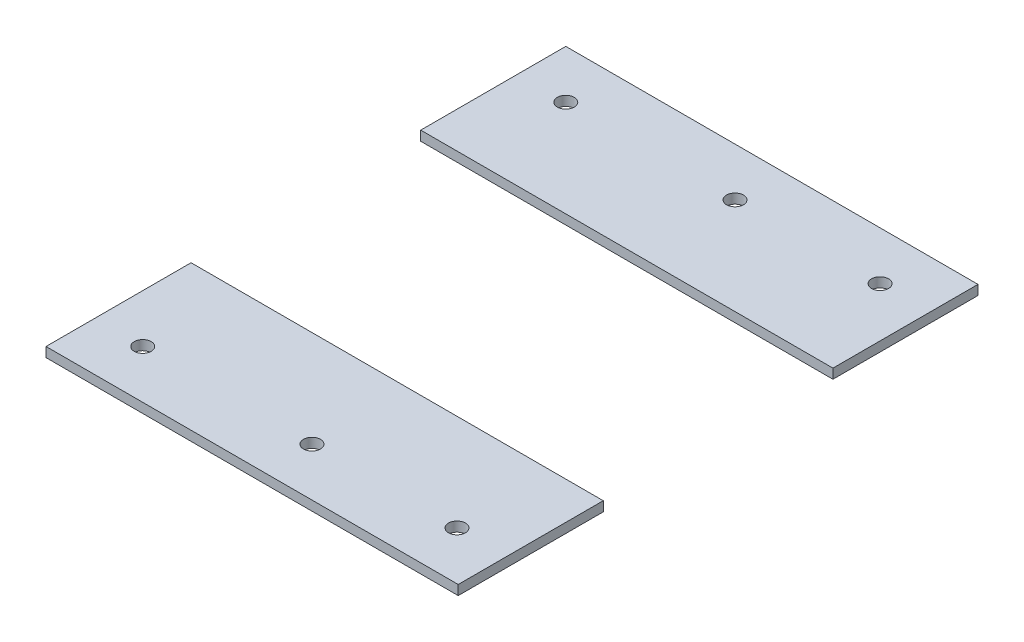
ISO-10303-21;
HEADER;
FILE_DESCRIPTION(('STEP AP214'),'2;1');
FILE_NAME('part.step','',(''),(''),'','','');
FILE_SCHEMA(('AUTOMOTIVE_DESIGN { 1 0 10303 214 1 1 1 1 }'));
ENDSEC;
DATA;
#1=APPLICATION_CONTEXT('core data for automotive mechanical design processes');
#2=APPLICATION_PROTOCOL_DEFINITION('international standard','automotive_design',2000,#1);
#3=PRODUCT_CONTEXT('',#1,'mechanical');
#4=PRODUCT('Part','Part','',(#3));
#5=PRODUCT_RELATED_PRODUCT_CATEGORY('part','',(#4));
#6=PRODUCT_DEFINITION_FORMATION('','',#4);
#7=PRODUCT_DEFINITION_CONTEXT('part definition',#1,'design');
#8=PRODUCT_DEFINITION('design','',#6,#7);
#9=PRODUCT_DEFINITION_SHAPE('','',#8);
#10=(LENGTH_UNIT() NAMED_UNIT(*) SI_UNIT(.MILLI.,.METRE.));
#11=(NAMED_UNIT(*) PLANE_ANGLE_UNIT() SI_UNIT($,.RADIAN.));
#12=(NAMED_UNIT(*) SI_UNIT($,.STERADIAN.) SOLID_ANGLE_UNIT());
#13=UNCERTAINTY_MEASURE_WITH_UNIT(LENGTH_MEASURE(1.E-05),#10,'distance_accuracy_value','');
#14=(GEOMETRIC_REPRESENTATION_CONTEXT(3) GLOBAL_UNCERTAINTY_ASSIGNED_CONTEXT((#13)) GLOBAL_UNIT_ASSIGNED_CONTEXT((#10,
#11,#12)) REPRESENTATION_CONTEXT('',''));
#15=CARTESIAN_POINT('',(0.,0.,0.));
#16=DIRECTION('',(0.,0.,1.));
#17=DIRECTION('',(1.,0.,0.));
#18=AXIS2_PLACEMENT_3D('',#15,#16,#17);
#19=CARTESIAN_POINT('',(0.,4.,0.));
#20=DIRECTION('',(0.,1.,0.));
#21=DIRECTION('',(0.,0.,1.));
#22=AXIS2_PLACEMENT_3D('',#19,#20,#21);
#23=PLANE('',#22);
#24=DIRECTION('',(-1.,0.,0.));
#25=VECTOR('',#24,1.);
#26=CARTESIAN_POINT('',(0.,4.,-145.));
#27=LINE('',#26,#25);
#28=CARTESIAN_POINT('',(170.5,4.,-145.));
#29=VERTEX_POINT('',#28);
#30=CARTESIAN_POINT('',(0.,4.,-145.));
#31=VERTEX_POINT('',#30);
#32=EDGE_CURVE('E12',#29,#31,#27,.T.);
#33=ORIENTED_EDGE('',*,*,#32,.F.);
#34=DIRECTION('',(0.,0.,-1.));
#35=VECTOR('',#34,1.);
#36=CARTESIAN_POINT('',(170.5,4.,-205.));
#37=LINE('',#36,#35);
#38=CARTESIAN_POINT('',(170.5,4.,-205.));
#39=VERTEX_POINT('',#38);
#40=EDGE_CURVE('E101',#29,#39,#37,.T.);
#41=ORIENTED_EDGE('',*,*,#40,.T.);
#42=DIRECTION('',(-1.,0.,0.));
#43=VECTOR('',#42,1.);
#44=CARTESIAN_POINT('',(0.,4.,-205.));
#45=LINE('',#44,#43);
#46=CARTESIAN_POINT('',(0.,4.,-205.));
#47=VERTEX_POINT('',#46);
#48=EDGE_CURVE('E118',#39,#47,#45,.T.);
#49=ORIENTED_EDGE('',*,*,#48,.T.);
#50=DIRECTION('',(0.,0.,1.));
#51=VECTOR('',#50,1.);
#52=CARTESIAN_POINT('',(0.,4.,-205.));
#53=LINE('',#52,#51);
#54=EDGE_CURVE('E113',#47,#31,#53,.T.);
#55=ORIENTED_EDGE('',*,*,#54,.T.);
#56=EDGE_LOOP('',(#33,#41,#49,#55));
#57=FACE_BOUND('',#56,.T.);
#58=CARTESIAN_POINT('',(20.,4.,-185.));
#59=DIRECTION('',(0.,1.,0.));
#60=DIRECTION('',(0.,0.,1.));
#61=AXIS2_PLACEMENT_3D('',#58,#59,#60);
#62=CIRCLE('',#61,3.5);
#63=CARTESIAN_POINT('',(20.,4.,-181.5));
#64=VERTEX_POINT('',#63);
#65=EDGE_CURVE('E93',#64,#64,#62,.T.);
#66=ORIENTED_EDGE('',*,*,#65,.F.);
#67=EDGE_LOOP('',(#66));
#68=FACE_BOUND('',#67,.T.);
#69=CARTESIAN_POINT('',(90.,4.,-185.));
#70=DIRECTION('',(0.,1.,0.));
#71=DIRECTION('',(0.,0.,1.));
#72=AXIS2_PLACEMENT_3D('',#69,#70,#71);
#73=CIRCLE('',#72,3.50000000000001);
#74=CARTESIAN_POINT('',(90.,4.,-181.5));
#75=VERTEX_POINT('',#74);
#76=EDGE_CURVE('E134',#75,#75,#73,.T.);
#77=ORIENTED_EDGE('',*,*,#76,.F.);
#78=EDGE_LOOP('',(#77));
#79=FACE_BOUND('',#78,.T.);
#80=CARTESIAN_POINT('',(150.,4.,-185.));
#81=DIRECTION('',(0.,1.,0.));
#82=DIRECTION('',(0.,0.,1.));
#83=AXIS2_PLACEMENT_3D('',#80,#81,#82);
#84=CIRCLE('',#83,3.49999999999999);
#85=CARTESIAN_POINT('',(150.,4.,-181.5));
#86=VERTEX_POINT('',#85);
#87=EDGE_CURVE('E126',#86,#86,#84,.T.);
#88=ORIENTED_EDGE('',*,*,#87,.F.);
#89=EDGE_LOOP('',(#88));
#90=FACE_BOUND('',#89,.T.);
#91=ADVANCED_FACE('F49',(#57,#68,#79,#90),#23,.T.);
#92=CARTESIAN_POINT('',(0.,0.,0.));
#93=DIRECTION('',(0.,1.,0.));
#94=DIRECTION('',(0.,0.,1.));
#95=AXIS2_PLACEMENT_3D('',#92,#93,#94);
#96=PLANE('',#95);
#97=CARTESIAN_POINT('',(20.,0.,-185.));
#98=DIRECTION('',(0.,1.,0.));
#99=DIRECTION('',(0.,0.,1.));
#100=AXIS2_PLACEMENT_3D('',#97,#98,#99);
#101=CIRCLE('',#100,3.5);
#102=CARTESIAN_POINT('',(20.,0.,-181.5));
#103=VERTEX_POINT('',#102);
#104=EDGE_CURVE('E117',#103,#103,#101,.T.);
#105=ORIENTED_EDGE('',*,*,#104,.T.);
#106=EDGE_LOOP('',(#105));
#107=FACE_BOUND('',#106,.T.);
#108=CARTESIAN_POINT('',(150.,0.,-185.));
#109=DIRECTION('',(0.,1.,0.));
#110=DIRECTION('',(0.,0.,1.));
#111=AXIS2_PLACEMENT_3D('',#108,#109,#110);
#112=CIRCLE('',#111,3.49999999999999);
#113=CARTESIAN_POINT('',(150.,0.,-181.5));
#114=VERTEX_POINT('',#113);
#115=EDGE_CURVE('E130',#114,#114,#112,.T.);
#116=ORIENTED_EDGE('',*,*,#115,.T.);
#117=EDGE_LOOP('',(#116));
#118=FACE_BOUND('',#117,.T.);
#119=CARTESIAN_POINT('',(90.,0.,-185.));
#120=DIRECTION('',(0.,1.,0.));
#121=DIRECTION('',(0.,0.,1.));
#122=AXIS2_PLACEMENT_3D('',#119,#120,#121);
#123=CIRCLE('',#122,3.50000000000001);
#124=CARTESIAN_POINT('',(90.,0.,-181.5));
#125=VERTEX_POINT('',#124);
#126=EDGE_CURVE('E138',#125,#125,#123,.T.);
#127=ORIENTED_EDGE('',*,*,#126,.T.);
#128=EDGE_LOOP('',(#127));
#129=FACE_BOUND('',#128,.T.);
#130=DIRECTION('',(0.,0.,-1.));
#131=VECTOR('',#130,1.);
#132=CARTESIAN_POINT('',(170.5,0.,-205.));
#133=LINE('',#132,#131);
#134=CARTESIAN_POINT('',(170.5,0.,-145.));
#135=VERTEX_POINT('',#134);
#136=CARTESIAN_POINT('',(170.5,0.,-205.));
#137=VERTEX_POINT('',#136);
#138=EDGE_CURVE('E99',#135,#137,#133,.T.);
#139=ORIENTED_EDGE('',*,*,#138,.F.);
#140=DIRECTION('',(1.,0.,0.));
#141=VECTOR('',#140,1.);
#142=CARTESIAN_POINT('',(194.467368696575,0.,-145.));
#143=LINE('',#142,#141);
#144=CARTESIAN_POINT('',(0.,0.,-145.));
#145=VERTEX_POINT('',#144);
#146=EDGE_CURVE('E58',#145,#135,#143,.T.);
#147=ORIENTED_EDGE('',*,*,#146,.F.);
#148=DIRECTION('',(0.,0.,1.));
#149=VECTOR('',#148,1.);
#150=CARTESIAN_POINT('',(0.,0.,-205.));
#151=LINE('',#150,#149);
#152=CARTESIAN_POINT('',(0.,0.,-205.));
#153=VERTEX_POINT('',#152);
#154=EDGE_CURVE('E52',#153,#145,#151,.T.);
#155=ORIENTED_EDGE('',*,*,#154,.F.);
#156=DIRECTION('',(-1.,0.,0.));
#157=VECTOR('',#156,1.);
#158=CARTESIAN_POINT('',(0.,0.,-205.));
#159=LINE('',#158,#157);
#160=EDGE_CURVE('E107',#137,#153,#159,.T.);
#161=ORIENTED_EDGE('',*,*,#160,.F.);
#162=EDGE_LOOP('',(#139,#147,#155,#161));
#163=FACE_BOUND('',#162,.T.);
#164=ADVANCED_FACE('F106',(#107,#118,#129,#163),#96,.F.);
#165=CARTESIAN_POINT('',(0.,4.,-205.));
#166=DIRECTION('',(1.,0.,0.));
#167=DIRECTION('',(0.,0.,-1.));
#168=AXIS2_PLACEMENT_3D('',#165,#166,#167);
#169=PLANE('',#168);
#170=ORIENTED_EDGE('',*,*,#154,.T.);
#171=DIRECTION('',(0.,1.,0.));
#172=VECTOR('',#171,1.);
#173=CARTESIAN_POINT('',(0.,4.,-145.));
#174=LINE('',#173,#172);
#175=EDGE_CURVE('E65',#145,#31,#174,.T.);
#176=ORIENTED_EDGE('',*,*,#175,.T.);
#177=ORIENTED_EDGE('',*,*,#54,.F.);
#178=DIRECTION('',(0.,-1.,0.));
#179=VECTOR('',#178,1.);
#180=CARTESIAN_POINT('',(0.,4.,-205.));
#181=LINE('',#180,#179);
#182=EDGE_CURVE('E103',#47,#153,#181,.T.);
#183=ORIENTED_EDGE('',*,*,#182,.T.);
#184=EDGE_LOOP('',(#170,#176,#177,#183));
#185=FACE_BOUND('',#184,.T.);
#186=ADVANCED_FACE('F159',(#185),#169,.F.);
#187=CARTESIAN_POINT('',(170.5,4.,-205.));
#188=DIRECTION('',(-1.,0.,0.));
#189=DIRECTION('',(0.,0.,1.));
#190=AXIS2_PLACEMENT_3D('',#187,#188,#189);
#191=PLANE('',#190);
#192=ORIENTED_EDGE('',*,*,#40,.F.);
#193=DIRECTION('',(0.,-1.,0.));
#194=VECTOR('',#193,1.);
#195=CARTESIAN_POINT('',(170.5,4.,-145.));
#196=LINE('',#195,#194);
#197=EDGE_CURVE('E87',#29,#135,#196,.T.);
#198=ORIENTED_EDGE('',*,*,#197,.T.);
#199=ORIENTED_EDGE('',*,*,#138,.T.);
#200=DIRECTION('',(0.,-1.,0.));
#201=VECTOR('',#200,1.);
#202=CARTESIAN_POINT('',(170.5,4.,-205.));
#203=LINE('',#202,#201);
#204=EDGE_CURVE('E110',#39,#137,#203,.T.);
#205=ORIENTED_EDGE('',*,*,#204,.F.);
#206=EDGE_LOOP('',(#192,#198,#199,#205));
#207=FACE_BOUND('',#206,.T.);
#208=ADVANCED_FACE('F97',(#207),#191,.F.);
#209=CARTESIAN_POINT('',(0.,4.,-205.));
#210=DIRECTION('',(0.,0.,1.));
#211=DIRECTION('',(1.,0.,0.));
#212=AXIS2_PLACEMENT_3D('',#209,#210,#211);
#213=PLANE('',#212);
#214=ORIENTED_EDGE('',*,*,#160,.T.);
#215=ORIENTED_EDGE('',*,*,#182,.F.);
#216=ORIENTED_EDGE('',*,*,#48,.F.);
#217=ORIENTED_EDGE('',*,*,#204,.T.);
#218=EDGE_LOOP('',(#214,#215,#216,#217));
#219=FACE_BOUND('',#218,.T.);
#220=ADVANCED_FACE('F153',(#219),#213,.F.);
#221=CARTESIAN_POINT('',(90.,4.,-185.));
#222=DIRECTION('',(0.,-1.,0.));
#223=DIRECTION('',(0.,0.,-1.));
#224=AXIS2_PLACEMENT_3D('',#221,#222,#223);
#225=CYLINDRICAL_SURFACE('',#224,3.50000000000001);
#226=ORIENTED_EDGE('',*,*,#76,.T.);
#227=EDGE_LOOP('',(#226));
#228=FACE_BOUND('',#227,.T.);
#229=ORIENTED_EDGE('',*,*,#126,.F.);
#230=EDGE_LOOP('',(#229));
#231=FACE_BOUND('',#230,.T.);
#232=ADVANCED_FACE('F195',(#228,#231),#225,.F.);
#233=CARTESIAN_POINT('',(150.,4.,-185.));
#234=DIRECTION('',(0.,-1.,0.));
#235=DIRECTION('',(0.,0.,-1.));
#236=AXIS2_PLACEMENT_3D('',#233,#234,#235);
#237=CYLINDRICAL_SURFACE('',#236,3.49999999999999);
#238=ORIENTED_EDGE('',*,*,#87,.T.);
#239=EDGE_LOOP('',(#238));
#240=FACE_BOUND('',#239,.T.);
#241=ORIENTED_EDGE('',*,*,#115,.F.);
#242=EDGE_LOOP('',(#241));
#243=FACE_BOUND('',#242,.T.);
#244=ADVANCED_FACE('F204',(#240,#243),#237,.F.);
#245=CARTESIAN_POINT('',(20.,4.,-185.));
#246=DIRECTION('',(0.,-1.,0.));
#247=DIRECTION('',(0.,0.,-1.));
#248=AXIS2_PLACEMENT_3D('',#245,#246,#247);
#249=CYLINDRICAL_SURFACE('',#248,3.5);
#250=ORIENTED_EDGE('',*,*,#65,.T.);
#251=EDGE_LOOP('',(#250));
#252=FACE_BOUND('',#251,.T.);
#253=ORIENTED_EDGE('',*,*,#104,.F.);
#254=EDGE_LOOP('',(#253));
#255=FACE_BOUND('',#254,.T.);
#256=ADVANCED_FACE('F214',(#252,#255),#249,.F.);
#257=CARTESIAN_POINT('',(194.467368696575,10.,-145.));
#258=DIRECTION('',(0.,0.,-1.));
#259=DIRECTION('',(-1.,0.,0.));
#260=AXIS2_PLACEMENT_3D('',#257,#258,#259);
#261=PLANE('',#260);
#262=ORIENTED_EDGE('',*,*,#146,.T.);
#263=ORIENTED_EDGE('',*,*,#197,.F.);
#264=ORIENTED_EDGE('',*,*,#32,.T.);
#265=ORIENTED_EDGE('',*,*,#175,.F.);
#266=EDGE_LOOP('',(#262,#263,#264,#265));
#267=FACE_BOUND('',#266,.T.);
#268=ADVANCED_FACE('F86',(#267),#261,.F.);
#269=CLOSED_SHELL('',(#91,#164,#186,#208,#220,#232,#244,#256,#268));
#270=MANIFOLD_SOLID_BREP('B2',#269);
#271=CARTESIAN_POINT('',(90.,4.,-10.));
#272=DIRECTION('',(0.,-1.,0.));
#273=DIRECTION('',(0.,0.,-1.));
#274=AXIS2_PLACEMENT_3D('',#271,#272,#273);
#275=CYLINDRICAL_SURFACE('',#274,3.50000000000001);
#276=CARTESIAN_POINT('',(90.,4.,-10.));
#277=DIRECTION('',(0.,1.,0.));
#278=DIRECTION('',(0.,0.,1.));
#279=AXIS2_PLACEMENT_3D('',#276,#277,#278);
#280=CIRCLE('',#279,3.50000000000001);
#281=CARTESIAN_POINT('',(90.,4.,-6.5));
#282=VERTEX_POINT('',#281);
#283=EDGE_CURVE('E330',#282,#282,#280,.T.);
#284=ORIENTED_EDGE('',*,*,#283,.T.);
#285=EDGE_LOOP('',(#284));
#286=FACE_BOUND('',#285,.T.);
#287=CARTESIAN_POINT('',(90.,0.,-10.));
#288=DIRECTION('',(0.,1.,0.));
#289=DIRECTION('',(0.,0.,1.));
#290=AXIS2_PLACEMENT_3D('',#287,#288,#289);
#291=CIRCLE('',#290,3.50000000000001);
#292=CARTESIAN_POINT('',(90.,0.,-6.5));
#293=VERTEX_POINT('',#292);
#294=EDGE_CURVE('E333',#293,#293,#291,.T.);
#295=ORIENTED_EDGE('',*,*,#294,.F.);
#296=EDGE_LOOP('',(#295));
#297=FACE_BOUND('',#296,.T.);
#298=ADVANCED_FACE('F254',(#286,#297),#275,.F.);
#299=CARTESIAN_POINT('',(150.,4.,-10.));
#300=DIRECTION('',(0.,-1.,0.));
#301=DIRECTION('',(0.,0.,-1.));
#302=AXIS2_PLACEMENT_3D('',#299,#300,#301);
#303=CYLINDRICAL_SURFACE('',#302,3.49999999999999);
#304=CARTESIAN_POINT('',(150.,4.,-10.));
#305=DIRECTION('',(0.,1.,0.));
#306=DIRECTION('',(0.,0.,1.));
#307=AXIS2_PLACEMENT_3D('',#304,#305,#306);
#308=CIRCLE('',#307,3.49999999999999);
#309=CARTESIAN_POINT('',(150.,4.,-6.50000000000001));
#310=VERTEX_POINT('',#309);
#311=EDGE_CURVE('E324',#310,#310,#308,.T.);
#312=ORIENTED_EDGE('',*,*,#311,.T.);
#313=EDGE_LOOP('',(#312));
#314=FACE_BOUND('',#313,.T.);
#315=CARTESIAN_POINT('',(150.,0.,-10.));
#316=DIRECTION('',(0.,1.,0.));
#317=DIRECTION('',(0.,0.,1.));
#318=AXIS2_PLACEMENT_3D('',#315,#316,#317);
#319=CIRCLE('',#318,3.49999999999999);
#320=CARTESIAN_POINT('',(150.,0.,-6.50000000000001));
#321=VERTEX_POINT('',#320);
#322=EDGE_CURVE('E327',#321,#321,#319,.T.);
#323=ORIENTED_EDGE('',*,*,#322,.F.);
#324=EDGE_LOOP('',(#323));
#325=FACE_BOUND('',#324,.T.);
#326=ADVANCED_FACE('F357',(#314,#325),#303,.F.);
#327=CARTESIAN_POINT('',(20.,4.,-10.));
#328=DIRECTION('',(0.,-1.,0.));
#329=DIRECTION('',(0.,0.,-1.));
#330=AXIS2_PLACEMENT_3D('',#327,#328,#329);
#331=CYLINDRICAL_SURFACE('',#330,3.5);
#332=CARTESIAN_POINT('',(20.,4.,-10.));
#333=DIRECTION('',(0.,1.,0.));
#334=DIRECTION('',(0.,0.,1.));
#335=AXIS2_PLACEMENT_3D('',#332,#333,#334);
#336=CIRCLE('',#335,3.5);
#337=CARTESIAN_POINT('',(20.,4.,-6.5));
#338=VERTEX_POINT('',#337);
#339=EDGE_CURVE('E318',#338,#338,#336,.T.);
#340=ORIENTED_EDGE('',*,*,#339,.T.);
#341=EDGE_LOOP('',(#340));
#342=FACE_BOUND('',#341,.T.);
#343=CARTESIAN_POINT('',(20.,0.,-10.));
#344=DIRECTION('',(0.,1.,0.));
#345=DIRECTION('',(0.,0.,1.));
#346=AXIS2_PLACEMENT_3D('',#343,#344,#345);
#347=CIRCLE('',#346,3.5);
#348=CARTESIAN_POINT('',(20.,0.,-6.5));
#349=VERTEX_POINT('',#348);
#350=EDGE_CURVE('E321',#349,#349,#347,.T.);
#351=ORIENTED_EDGE('',*,*,#350,.F.);
#352=EDGE_LOOP('',(#351));
#353=FACE_BOUND('',#352,.T.);
#354=ADVANCED_FACE('F360',(#342,#353),#331,.F.);
#355=CARTESIAN_POINT('',(0.,4.,10.));
#356=DIRECTION('',(0.,0.,-1.));
#357=DIRECTION('',(-1.,0.,0.));
#358=AXIS2_PLACEMENT_3D('',#355,#356,#357);
#359=PLANE('',#358);
#360=DIRECTION('',(1.,0.,0.));
#361=VECTOR('',#360,1.);
#362=CARTESIAN_POINT('',(0.,0.,10.));
#363=LINE('',#362,#361);
#364=CARTESIAN_POINT('',(0.,0.,10.));
#365=VERTEX_POINT('',#364);
#366=CARTESIAN_POINT('',(170.5,0.,10.));
#367=VERTEX_POINT('',#366);
#368=EDGE_CURVE('E290',#365,#367,#363,.T.);
#369=ORIENTED_EDGE('',*,*,#368,.T.);
#370=DIRECTION('',(0.,-1.,0.));
#371=VECTOR('',#370,1.);
#372=CARTESIAN_POINT('',(170.5,4.,10.));
#373=LINE('',#372,#371);
#374=CARTESIAN_POINT('',(170.5,4.,10.));
#375=VERTEX_POINT('',#374);
#376=EDGE_CURVE('E293',#375,#367,#373,.T.);
#377=ORIENTED_EDGE('',*,*,#376,.F.);
#378=DIRECTION('',(1.,0.,0.));
#379=VECTOR('',#378,1.);
#380=CARTESIAN_POINT('',(0.,4.,10.));
#381=LINE('',#380,#379);
#382=CARTESIAN_POINT('',(0.,4.,10.));
#383=VERTEX_POINT('',#382);
#384=EDGE_CURVE('E277',#383,#375,#381,.T.);
#385=ORIENTED_EDGE('',*,*,#384,.F.);
#386=DIRECTION('',(0.,-1.,0.));
#387=VECTOR('',#386,1.);
#388=CARTESIAN_POINT('',(0.,4.,10.));
#389=LINE('',#388,#387);
#390=EDGE_CURVE('E262',#383,#365,#389,.T.);
#391=ORIENTED_EDGE('',*,*,#390,.T.);
#392=EDGE_LOOP('',(#369,#377,#385,#391));
#393=FACE_BOUND('',#392,.T.);
#394=ADVANCED_FACE('F292',(#393),#359,.F.);
#395=CARTESIAN_POINT('',(170.5,4.,-205.));
#396=DIRECTION('',(-1.,0.,0.));
#397=DIRECTION('',(0.,0.,1.));
#398=AXIS2_PLACEMENT_3D('',#395,#396,#397);
#399=PLANE('',#398);
#400=DIRECTION('',(0.,0.,-1.));
#401=VECTOR('',#400,1.);
#402=CARTESIAN_POINT('',(170.5,0.,-205.));
#403=LINE('',#402,#401);
#404=CARTESIAN_POINT('',(170.5,0.,-50.));
#405=VERTEX_POINT('',#404);
#406=EDGE_CURVE('E299',#367,#405,#403,.T.);
#407=ORIENTED_EDGE('',*,*,#406,.T.);
#408=DIRECTION('',(0.,1.,0.));
#409=VECTOR('',#408,1.);
#410=CARTESIAN_POINT('',(170.5,4.,-50.));
#411=LINE('',#410,#409);
#412=CARTESIAN_POINT('',(170.5,4.,-50.));
#413=VERTEX_POINT('',#412);
#414=EDGE_CURVE('E47',#405,#413,#411,.T.);
#415=ORIENTED_EDGE('',*,*,#414,.T.);
#416=DIRECTION('',(0.,0.,-1.));
#417=VECTOR('',#416,1.);
#418=CARTESIAN_POINT('',(170.5,4.,-205.));
#419=LINE('',#418,#417);
#420=EDGE_CURVE('E306',#375,#413,#419,.T.);
#421=ORIENTED_EDGE('',*,*,#420,.F.);
#422=ORIENTED_EDGE('',*,*,#376,.T.);
#423=EDGE_LOOP('',(#407,#415,#421,#422));
#424=FACE_BOUND('',#423,.T.);
#425=ADVANCED_FACE('F304',(#424),#399,.F.);
#426=CARTESIAN_POINT('',(0.,4.,-205.));
#427=DIRECTION('',(1.,0.,0.));
#428=DIRECTION('',(0.,0.,-1.));
#429=AXIS2_PLACEMENT_3D('',#426,#427,#428);
#430=PLANE('',#429);
#431=DIRECTION('',(0.,0.,1.));
#432=VECTOR('',#431,1.);
#433=CARTESIAN_POINT('',(0.,4.,-205.));
#434=LINE('',#433,#432);
#435=CARTESIAN_POINT('',(0.,4.,-50.));
#436=VERTEX_POINT('',#435);
#437=EDGE_CURVE('E313',#436,#383,#434,.T.);
#438=ORIENTED_EDGE('',*,*,#437,.F.);
#439=DIRECTION('',(0.,-1.,0.));
#440=VECTOR('',#439,1.);
#441=CARTESIAN_POINT('',(0.,4.,-50.));
#442=LINE('',#441,#440);
#443=CARTESIAN_POINT('',(0.,0.,-50.));
#444=VERTEX_POINT('',#443);
#445=EDGE_CURVE('E336',#436,#444,#442,.T.);
#446=ORIENTED_EDGE('',*,*,#445,.T.);
#447=DIRECTION('',(0.,0.,1.));
#448=VECTOR('',#447,1.);
#449=CARTESIAN_POINT('',(0.,0.,-205.));
#450=LINE('',#449,#448);
#451=EDGE_CURVE('E300',#444,#365,#450,.T.);
#452=ORIENTED_EDGE('',*,*,#451,.T.);
#453=ORIENTED_EDGE('',*,*,#390,.F.);
#454=EDGE_LOOP('',(#438,#446,#452,#453));
#455=FACE_BOUND('',#454,.T.);
#456=ADVANCED_FACE('F256',(#455),#430,.F.);
#457=CARTESIAN_POINT('',(0.,0.,0.));
#458=DIRECTION('',(0.,1.,0.));
#459=DIRECTION('',(0.,0.,1.));
#460=AXIS2_PLACEMENT_3D('',#457,#458,#459);
#461=PLANE('',#460);
#462=ORIENTED_EDGE('',*,*,#451,.F.);
#463=DIRECTION('',(-1.,0.,0.));
#464=VECTOR('',#463,1.);
#465=CARTESIAN_POINT('',(194.467368696575,0.,-50.));
#466=LINE('',#465,#464);
#467=EDGE_CURVE('E312',#405,#444,#466,.T.);
#468=ORIENTED_EDGE('',*,*,#467,.F.);
#469=ORIENTED_EDGE('',*,*,#406,.F.);
#470=ORIENTED_EDGE('',*,*,#368,.F.);
#471=EDGE_LOOP('',(#462,#468,#469,#470));
#472=FACE_BOUND('',#471,.T.);
#473=ORIENTED_EDGE('',*,*,#350,.T.);
#474=EDGE_LOOP('',(#473));
#475=FACE_BOUND('',#474,.T.);
#476=ORIENTED_EDGE('',*,*,#322,.T.);
#477=EDGE_LOOP('',(#476));
#478=FACE_BOUND('',#477,.T.);
#479=ORIENTED_EDGE('',*,*,#294,.T.);
#480=EDGE_LOOP('',(#479));
#481=FACE_BOUND('',#480,.T.);
#482=ADVANCED_FACE('F309',(#472,#475,#478,#481),#461,.F.);
#483=CARTESIAN_POINT('',(0.,4.,0.));
#484=DIRECTION('',(0.,1.,0.));
#485=DIRECTION('',(0.,0.,1.));
#486=AXIS2_PLACEMENT_3D('',#483,#484,#485);
#487=PLANE('',#486);
#488=DIRECTION('',(1.,0.,0.));
#489=VECTOR('',#488,1.);
#490=CARTESIAN_POINT('',(0.,4.,-50.));
#491=LINE('',#490,#489);
#492=EDGE_CURVE('E269',#436,#413,#491,.T.);
#493=ORIENTED_EDGE('',*,*,#492,.F.);
#494=ORIENTED_EDGE('',*,*,#437,.T.);
#495=ORIENTED_EDGE('',*,*,#384,.T.);
#496=ORIENTED_EDGE('',*,*,#420,.T.);
#497=EDGE_LOOP('',(#493,#494,#495,#496));
#498=FACE_BOUND('',#497,.T.);
#499=ORIENTED_EDGE('',*,*,#283,.F.);
#500=EDGE_LOOP('',(#499));
#501=FACE_BOUND('',#500,.T.);
#502=ORIENTED_EDGE('',*,*,#339,.F.);
#503=EDGE_LOOP('',(#502));
#504=FACE_BOUND('',#503,.T.);
#505=ORIENTED_EDGE('',*,*,#311,.F.);
#506=EDGE_LOOP('',(#505));
#507=FACE_BOUND('',#506,.T.);
#508=ADVANCED_FACE('F347',(#498,#501,#504,#507),#487,.T.);
#509=CARTESIAN_POINT('',(194.467368696575,10.,-50.));
#510=DIRECTION('',(0.,0.,1.));
#511=DIRECTION('',(1.,0.,0.));
#512=AXIS2_PLACEMENT_3D('',#509,#510,#511);
#513=PLANE('',#512);
#514=ORIENTED_EDGE('',*,*,#492,.T.);
#515=ORIENTED_EDGE('',*,*,#414,.F.);
#516=ORIENTED_EDGE('',*,*,#467,.T.);
#517=ORIENTED_EDGE('',*,*,#445,.F.);
#518=EDGE_LOOP('',(#514,#515,#516,#517));
#519=FACE_BOUND('',#518,.T.);
#520=ADVANCED_FACE('F343',(#519),#513,.F.);
#521=CLOSED_SHELL('',(#298,#326,#354,#394,#425,#456,#482,#508,#520));
#522=MANIFOLD_SOLID_BREP('B6',#521);
#523=ADVANCED_BREP_SHAPE_REPRESENTATION('',(#18,#270,#522),#14);
#524=SHAPE_DEFINITION_REPRESENTATION(#9,#523);
ENDSEC;
END-ISO-10303-21;
